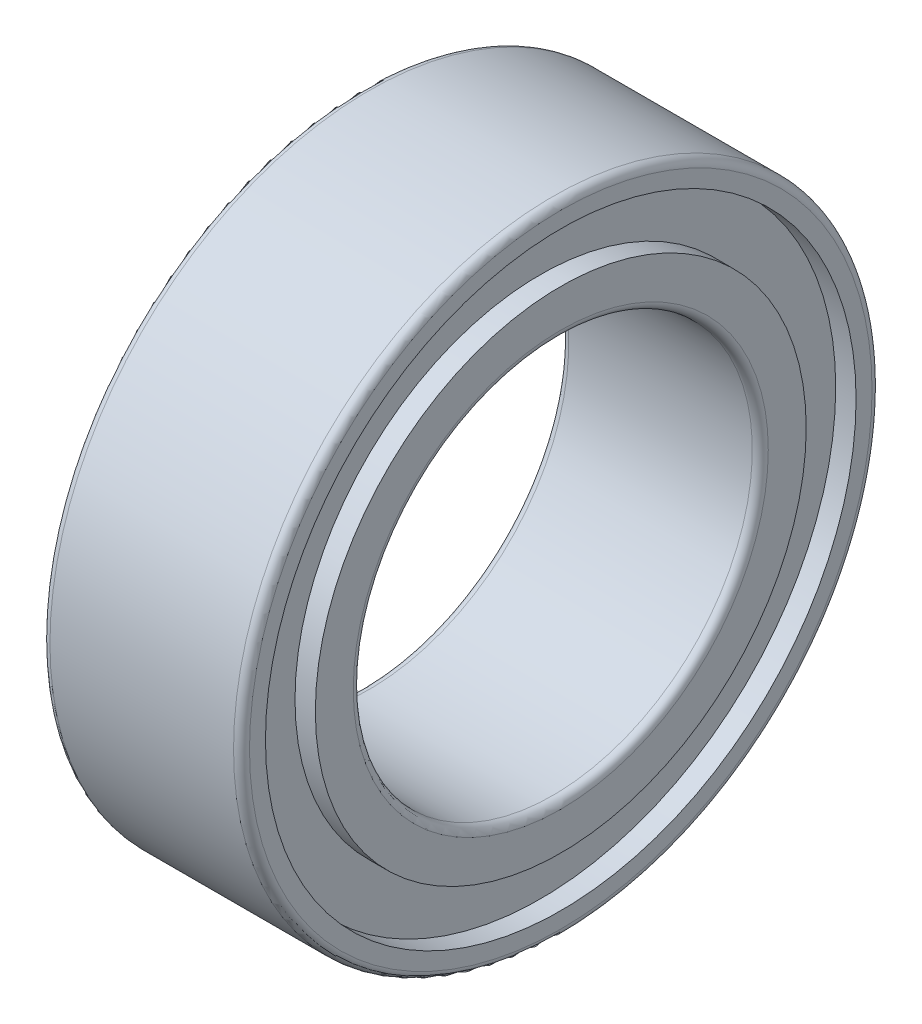
ISO-10303-21;
HEADER;
FILE_DESCRIPTION(('STEP AP214'),'2;1');
FILE_NAME('part.step','',(''),(''),'','','');
FILE_SCHEMA(('AUTOMOTIVE_DESIGN { 1 0 10303 214 1 1 1 1 }'));
ENDSEC;
DATA;
#1=APPLICATION_CONTEXT('core data for automotive mechanical design processes');
#2=APPLICATION_PROTOCOL_DEFINITION('international standard','automotive_design',2000,#1);
#3=PRODUCT_CONTEXT('',#1,'mechanical');
#4=PRODUCT('Part','Part','',(#3));
#5=PRODUCT_RELATED_PRODUCT_CATEGORY('part','',(#4));
#6=PRODUCT_DEFINITION_FORMATION('','',#4);
#7=PRODUCT_DEFINITION_CONTEXT('part definition',#1,'design');
#8=PRODUCT_DEFINITION('design','',#6,#7);
#9=PRODUCT_DEFINITION_SHAPE('','',#8);
#10=(LENGTH_UNIT() NAMED_UNIT(*) SI_UNIT(.MILLI.,.METRE.));
#11=(NAMED_UNIT(*) PLANE_ANGLE_UNIT() SI_UNIT($,.RADIAN.));
#12=(NAMED_UNIT(*) SI_UNIT($,.STERADIAN.) SOLID_ANGLE_UNIT());
#13=UNCERTAINTY_MEASURE_WITH_UNIT(LENGTH_MEASURE(1.E-05),#10,'distance_accuracy_value','');
#14=(GEOMETRIC_REPRESENTATION_CONTEXT(3) GLOBAL_UNCERTAINTY_ASSIGNED_CONTEXT((#13)) GLOBAL_UNIT_ASSIGNED_CONTEXT((#10,
#11,#12)) REPRESENTATION_CONTEXT('',''));
#15=CARTESIAN_POINT('',(0.,0.,0.));
#16=DIRECTION('',(0.,0.,1.));
#17=DIRECTION('',(1.,0.,0.));
#18=AXIS2_PLACEMENT_3D('',#15,#16,#17);
#19=CARTESIAN_POINT('',(0.0999999999999222,0.,0.));
#20=DIRECTION('',(-1.,0.,0.));
#21=DIRECTION('',(0.,0.,1.));
#22=AXIS2_PLACEMENT_3D('',#19,#20,#21);
#23=TOROIDAL_SURFACE('',#22,3.90000000000008,0.099999999999922);
#24=CARTESIAN_POINT('',(0.,0.,0.));
#25=DIRECTION('',(-1.,0.,0.));
#26=DIRECTION('',(0.,0.,1.));
#27=AXIS2_PLACEMENT_3D('',#24,#25,#26);
#28=CIRCLE('',#27,3.9);
#29=CARTESIAN_POINT('',(0.,0.,3.9));
#30=VERTEX_POINT('',#29);
#31=EDGE_CURVE('E10',#30,#30,#28,.T.);
#32=ORIENTED_EDGE('',*,*,#31,.F.);
#33=EDGE_LOOP('',(#32));
#34=FACE_BOUND('',#33,.T.);
#35=CARTESIAN_POINT('',(0.0999999999999998,0.,0.));
#36=DIRECTION('',(-1.,0.,0.));
#37=DIRECTION('',(0.,0.,1.));
#38=AXIS2_PLACEMENT_3D('',#35,#36,#37);
#39=CIRCLE('',#38,4.);
#40=CARTESIAN_POINT('',(0.0999999999999998,0.,4.));
#41=VERTEX_POINT('',#40);
#42=EDGE_CURVE('E81',#41,#41,#39,.T.);
#43=ORIENTED_EDGE('',*,*,#42,.T.);
#44=EDGE_LOOP('',(#43));
#45=FACE_BOUND('',#44,.T.);
#46=ADVANCED_FACE('F29',(#34,#45),#23,.T.);
#47=CARTESIAN_POINT('',(0.,3.9,0.));
#48=DIRECTION('',(1.,0.,0.));
#49=DIRECTION('',(0.,0.,-1.));
#50=AXIS2_PLACEMENT_3D('',#47,#48,#49);
#51=PLANE('',#50);
#52=CARTESIAN_POINT('',(0.,0.,0.));
#53=DIRECTION('',(-1.,0.,0.));
#54=DIRECTION('',(0.,0.,1.));
#55=AXIS2_PLACEMENT_3D('',#52,#53,#54);
#56=CIRCLE('',#55,3.7);
#57=CARTESIAN_POINT('',(0.,0.,3.7));
#58=VERTEX_POINT('',#57);
#59=EDGE_CURVE('E35',#58,#58,#56,.T.);
#60=ORIENTED_EDGE('',*,*,#59,.F.);
#61=EDGE_LOOP('',(#60));
#62=FACE_BOUND('',#61,.T.);
#63=ORIENTED_EDGE('',*,*,#31,.T.);
#64=EDGE_LOOP('',(#63));
#65=FACE_BOUND('',#64,.T.);
#66=ADVANCED_FACE('F166',(#62,#65),#51,.F.);
#67=CARTESIAN_POINT('',(2.4,0.,0.));
#68=DIRECTION('',(-1.,0.,0.));
#69=DIRECTION('',(0.,0.,1.));
#70=AXIS2_PLACEMENT_3D('',#67,#68,#69);
#71=CYLINDRICAL_SURFACE('',#70,3.7);
#72=CARTESIAN_POINT('',(0.255,0.,0.));
#73=DIRECTION('',(-1.,0.,0.));
#74=DIRECTION('',(0.,0.,1.));
#75=AXIS2_PLACEMENT_3D('',#72,#73,#74);
#76=CIRCLE('',#75,3.7);
#77=CARTESIAN_POINT('',(0.255,0.,3.7));
#78=VERTEX_POINT('',#77);
#79=EDGE_CURVE('E39',#78,#78,#76,.T.);
#80=ORIENTED_EDGE('',*,*,#79,.F.);
#81=EDGE_LOOP('',(#80));
#82=FACE_BOUND('',#81,.T.);
#83=ORIENTED_EDGE('',*,*,#59,.T.);
#84=EDGE_LOOP('',(#83));
#85=FACE_BOUND('',#84,.T.);
#86=ADVANCED_FACE('F161',(#82,#85),#71,.F.);
#87=CARTESIAN_POINT('',(0.255,3.7,0.));
#88=DIRECTION('',(1.,0.,0.));
#89=DIRECTION('',(0.,0.,-1.));
#90=AXIS2_PLACEMENT_3D('',#87,#88,#89);
#91=PLANE('',#90);
#92=CARTESIAN_POINT('',(0.255,0.,0.));
#93=DIRECTION('',(-1.,0.,0.));
#94=DIRECTION('',(0.,0.,1.));
#95=AXIS2_PLACEMENT_3D('',#92,#93,#94);
#96=CIRCLE('',#95,3.075);
#97=CARTESIAN_POINT('',(0.255,0.,3.075));
#98=VERTEX_POINT('',#97);
#99=EDGE_CURVE('E43',#98,#98,#96,.T.);
#100=ORIENTED_EDGE('',*,*,#99,.F.);
#101=EDGE_LOOP('',(#100));
#102=FACE_BOUND('',#101,.T.);
#103=ORIENTED_EDGE('',*,*,#79,.T.);
#104=EDGE_LOOP('',(#103));
#105=FACE_BOUND('',#104,.T.);
#106=ADVANCED_FACE('F155',(#102,#105),#91,.F.);
#107=CARTESIAN_POINT('',(2.4,0.,0.));
#108=DIRECTION('',(-1.,0.,0.));
#109=DIRECTION('',(0.,0.,1.));
#110=AXIS2_PLACEMENT_3D('',#107,#108,#109);
#111=CYLINDRICAL_SURFACE('',#110,3.075);
#112=CARTESIAN_POINT('',(0.,0.,0.));
#113=DIRECTION('',(-1.,0.,0.));
#114=DIRECTION('',(0.,0.,1.));
#115=AXIS2_PLACEMENT_3D('',#112,#113,#114);
#116=CIRCLE('',#115,3.075);
#117=CARTESIAN_POINT('',(0.,0.,3.075));
#118=VERTEX_POINT('',#117);
#119=EDGE_CURVE('E48',#118,#118,#116,.T.);
#120=ORIENTED_EDGE('',*,*,#119,.F.);
#121=EDGE_LOOP('',(#120));
#122=FACE_BOUND('',#121,.T.);
#123=ORIENTED_EDGE('',*,*,#99,.T.);
#124=EDGE_LOOP('',(#123));
#125=FACE_BOUND('',#124,.T.);
#126=ADVANCED_FACE('F149',(#122,#125),#111,.T.);
#127=CARTESIAN_POINT('',(0.,3.075,0.));
#128=DIRECTION('',(1.,0.,0.));
#129=DIRECTION('',(0.,0.,-1.));
#130=AXIS2_PLACEMENT_3D('',#127,#128,#129);
#131=PLANE('',#130);
#132=CARTESIAN_POINT('',(0.,0.,0.));
#133=DIRECTION('',(-1.,0.,0.));
#134=DIRECTION('',(0.,0.,1.));
#135=AXIS2_PLACEMENT_3D('',#132,#133,#134);
#136=CIRCLE('',#135,2.6);
#137=CARTESIAN_POINT('',(0.,0.,2.6));
#138=VERTEX_POINT('',#137);
#139=EDGE_CURVE('E51',#138,#138,#136,.T.);
#140=ORIENTED_EDGE('',*,*,#139,.F.);
#141=EDGE_LOOP('',(#140));
#142=FACE_BOUND('',#141,.T.);
#143=ORIENTED_EDGE('',*,*,#119,.T.);
#144=EDGE_LOOP('',(#143));
#145=FACE_BOUND('',#144,.T.);
#146=ADVANCED_FACE('F143',(#142,#145),#131,.F.);
#147=CARTESIAN_POINT('',(0.0999999999999218,0.,0.));
#148=DIRECTION('',(-1.,0.,0.));
#149=DIRECTION('',(0.,0.,1.));
#150=AXIS2_PLACEMENT_3D('',#147,#148,#149);
#151=TOROIDAL_SURFACE('',#150,2.59999999999992,0.099999999999922);
#152=CARTESIAN_POINT('',(0.0999999999999998,0.,0.));
#153=DIRECTION('',(-1.,0.,0.));
#154=DIRECTION('',(0.,0.,1.));
#155=AXIS2_PLACEMENT_3D('',#152,#153,#154);
#156=CIRCLE('',#155,2.5);
#157=CARTESIAN_POINT('',(0.0999999999999998,0.,2.5));
#158=VERTEX_POINT('',#157);
#159=EDGE_CURVE('E54',#158,#158,#156,.T.);
#160=ORIENTED_EDGE('',*,*,#159,.F.);
#161=EDGE_LOOP('',(#160));
#162=FACE_BOUND('',#161,.T.);
#163=ORIENTED_EDGE('',*,*,#139,.T.);
#164=EDGE_LOOP('',(#163));
#165=FACE_BOUND('',#164,.T.);
#166=ADVANCED_FACE('F137',(#162,#165),#151,.T.);
#167=CARTESIAN_POINT('',(2.4,0.,0.));
#168=DIRECTION('',(-1.,0.,0.));
#169=DIRECTION('',(0.,0.,1.));
#170=AXIS2_PLACEMENT_3D('',#167,#168,#169);
#171=CYLINDRICAL_SURFACE('',#170,2.5);
#172=CARTESIAN_POINT('',(2.4,0.,0.));
#173=DIRECTION('',(-1.,0.,0.));
#174=DIRECTION('',(0.,0.,1.));
#175=AXIS2_PLACEMENT_3D('',#172,#173,#174);
#176=CIRCLE('',#175,2.5);
#177=CARTESIAN_POINT('',(2.4,0.,2.5));
#178=VERTEX_POINT('',#177);
#179=EDGE_CURVE('E57',#178,#178,#176,.T.);
#180=ORIENTED_EDGE('',*,*,#179,.F.);
#181=EDGE_LOOP('',(#180));
#182=FACE_BOUND('',#181,.T.);
#183=ORIENTED_EDGE('',*,*,#159,.T.);
#184=EDGE_LOOP('',(#183));
#185=FACE_BOUND('',#184,.T.);
#186=ADVANCED_FACE('F131',(#182,#185),#171,.F.);
#187=CARTESIAN_POINT('',(2.40000000000015,0.,0.));
#188=DIRECTION('',(-1.,0.,0.));
#189=DIRECTION('',(0.,0.,1.));
#190=AXIS2_PLACEMENT_3D('',#187,#188,#189);
#191=TOROIDAL_SURFACE('',#190,2.59999999999985,0.099999999999845);
#192=CARTESIAN_POINT('',(2.5,0.,0.));
#193=DIRECTION('',(-1.,0.,0.));
#194=DIRECTION('',(0.,0.,1.));
#195=AXIS2_PLACEMENT_3D('',#192,#193,#194);
#196=CIRCLE('',#195,2.6);
#197=CARTESIAN_POINT('',(2.5,0.,2.6));
#198=VERTEX_POINT('',#197);
#199=EDGE_CURVE('E60',#198,#198,#196,.T.);
#200=ORIENTED_EDGE('',*,*,#199,.F.);
#201=EDGE_LOOP('',(#200));
#202=FACE_BOUND('',#201,.T.);
#203=ORIENTED_EDGE('',*,*,#179,.T.);
#204=EDGE_LOOP('',(#203));
#205=FACE_BOUND('',#204,.T.);
#206=ADVANCED_FACE('F125',(#202,#205),#191,.T.);
#207=CARTESIAN_POINT('',(2.5,2.6,0.));
#208=DIRECTION('',(-1.,0.,0.));
#209=DIRECTION('',(0.,0.,1.));
#210=AXIS2_PLACEMENT_3D('',#207,#208,#209);
#211=PLANE('',#210);
#212=CARTESIAN_POINT('',(2.5,0.,0.));
#213=DIRECTION('',(-1.,0.,0.));
#214=DIRECTION('',(0.,0.,1.));
#215=AXIS2_PLACEMENT_3D('',#212,#213,#214);
#216=CIRCLE('',#215,3.075);
#217=CARTESIAN_POINT('',(2.5,0.,3.075));
#218=VERTEX_POINT('',#217);
#219=EDGE_CURVE('E63',#218,#218,#216,.T.);
#220=ORIENTED_EDGE('',*,*,#219,.F.);
#221=EDGE_LOOP('',(#220));
#222=FACE_BOUND('',#221,.T.);
#223=ORIENTED_EDGE('',*,*,#199,.T.);
#224=EDGE_LOOP('',(#223));
#225=FACE_BOUND('',#224,.T.);
#226=ADVANCED_FACE('F119',(#222,#225),#211,.F.);
#227=CARTESIAN_POINT('',(2.4,0.,0.));
#228=DIRECTION('',(-1.,0.,0.));
#229=DIRECTION('',(0.,0.,1.));
#230=AXIS2_PLACEMENT_3D('',#227,#228,#229);
#231=CYLINDRICAL_SURFACE('',#230,3.075);
#232=CARTESIAN_POINT('',(2.245,0.,0.));
#233=DIRECTION('',(-1.,0.,0.));
#234=DIRECTION('',(0.,0.,1.));
#235=AXIS2_PLACEMENT_3D('',#232,#233,#234);
#236=CIRCLE('',#235,3.075);
#237=CARTESIAN_POINT('',(2.245,0.,3.075));
#238=VERTEX_POINT('',#237);
#239=EDGE_CURVE('E66',#238,#238,#236,.T.);
#240=ORIENTED_EDGE('',*,*,#239,.F.);
#241=EDGE_LOOP('',(#240));
#242=FACE_BOUND('',#241,.T.);
#243=ORIENTED_EDGE('',*,*,#219,.T.);
#244=EDGE_LOOP('',(#243));
#245=FACE_BOUND('',#244,.T.);
#246=ADVANCED_FACE('F113',(#242,#245),#231,.T.);
#247=CARTESIAN_POINT('',(2.245,3.075,0.));
#248=DIRECTION('',(-1.,0.,0.));
#249=DIRECTION('',(0.,0.,1.));
#250=AXIS2_PLACEMENT_3D('',#247,#248,#249);
#251=PLANE('',#250);
#252=CARTESIAN_POINT('',(2.245,0.,0.));
#253=DIRECTION('',(-1.,0.,0.));
#254=DIRECTION('',(0.,0.,1.));
#255=AXIS2_PLACEMENT_3D('',#252,#253,#254);
#256=CIRCLE('',#255,3.7);
#257=CARTESIAN_POINT('',(2.245,0.,3.7));
#258=VERTEX_POINT('',#257);
#259=EDGE_CURVE('E69',#258,#258,#256,.T.);
#260=ORIENTED_EDGE('',*,*,#259,.F.);
#261=EDGE_LOOP('',(#260));
#262=FACE_BOUND('',#261,.T.);
#263=ORIENTED_EDGE('',*,*,#239,.T.);
#264=EDGE_LOOP('',(#263));
#265=FACE_BOUND('',#264,.T.);
#266=ADVANCED_FACE('F107',(#262,#265),#251,.F.);
#267=CARTESIAN_POINT('',(2.4,0.,0.));
#268=DIRECTION('',(-1.,0.,0.));
#269=DIRECTION('',(0.,0.,1.));
#270=AXIS2_PLACEMENT_3D('',#267,#268,#269);
#271=CYLINDRICAL_SURFACE('',#270,3.7);
#272=CARTESIAN_POINT('',(2.5,0.,0.));
#273=DIRECTION('',(-1.,0.,0.));
#274=DIRECTION('',(0.,0.,1.));
#275=AXIS2_PLACEMENT_3D('',#272,#273,#274);
#276=CIRCLE('',#275,3.7);
#277=CARTESIAN_POINT('',(2.5,0.,3.7));
#278=VERTEX_POINT('',#277);
#279=EDGE_CURVE('E72',#278,#278,#276,.T.);
#280=ORIENTED_EDGE('',*,*,#279,.F.);
#281=EDGE_LOOP('',(#280));
#282=FACE_BOUND('',#281,.T.);
#283=ORIENTED_EDGE('',*,*,#259,.T.);
#284=EDGE_LOOP('',(#283));
#285=FACE_BOUND('',#284,.T.);
#286=ADVANCED_FACE('F101',(#282,#285),#271,.F.);
#287=CARTESIAN_POINT('',(2.5,3.7,0.));
#288=DIRECTION('',(-1.,0.,0.));
#289=DIRECTION('',(0.,0.,1.));
#290=AXIS2_PLACEMENT_3D('',#287,#288,#289);
#291=PLANE('',#290);
#292=CARTESIAN_POINT('',(2.5,0.,0.));
#293=DIRECTION('',(-1.,0.,0.));
#294=DIRECTION('',(0.,0.,1.));
#295=AXIS2_PLACEMENT_3D('',#292,#293,#294);
#296=CIRCLE('',#295,3.9);
#297=CARTESIAN_POINT('',(2.5,0.,3.9));
#298=VERTEX_POINT('',#297);
#299=EDGE_CURVE('E75',#298,#298,#296,.T.);
#300=ORIENTED_EDGE('',*,*,#299,.F.);
#301=EDGE_LOOP('',(#300));
#302=FACE_BOUND('',#301,.T.);
#303=ORIENTED_EDGE('',*,*,#279,.T.);
#304=EDGE_LOOP('',(#303));
#305=FACE_BOUND('',#304,.T.);
#306=ADVANCED_FACE('F95',(#302,#305),#291,.F.);
#307=CARTESIAN_POINT('',(2.40000000000015,0.,0.));
#308=DIRECTION('',(-1.,0.,0.));
#309=DIRECTION('',(0.,0.,1.));
#310=AXIS2_PLACEMENT_3D('',#307,#308,#309);
#311=TOROIDAL_SURFACE('',#310,3.90000000000015,0.0999999999998461);
#312=CARTESIAN_POINT('',(2.4,0.,0.));
#313=DIRECTION('',(-1.,0.,0.));
#314=DIRECTION('',(0.,0.,1.));
#315=AXIS2_PLACEMENT_3D('',#312,#313,#314);
#316=CIRCLE('',#315,4.);
#317=CARTESIAN_POINT('',(2.4,0.,4.));
#318=VERTEX_POINT('',#317);
#319=EDGE_CURVE('E78',#318,#318,#316,.T.);
#320=ORIENTED_EDGE('',*,*,#319,.F.);
#321=EDGE_LOOP('',(#320));
#322=FACE_BOUND('',#321,.T.);
#323=ORIENTED_EDGE('',*,*,#299,.T.);
#324=EDGE_LOOP('',(#323));
#325=FACE_BOUND('',#324,.T.);
#326=ADVANCED_FACE('F89',(#322,#325),#311,.T.);
#327=CARTESIAN_POINT('',(2.4,0.,0.));
#328=DIRECTION('',(-1.,0.,0.));
#329=DIRECTION('',(0.,0.,1.));
#330=AXIS2_PLACEMENT_3D('',#327,#328,#329);
#331=CYLINDRICAL_SURFACE('',#330,4.);
#332=ORIENTED_EDGE('',*,*,#42,.F.);
#333=EDGE_LOOP('',(#332));
#334=FACE_BOUND('',#333,.T.);
#335=ORIENTED_EDGE('',*,*,#319,.T.);
#336=EDGE_LOOP('',(#335));
#337=FACE_BOUND('',#336,.T.);
#338=ADVANCED_FACE('F86',(#334,#337),#331,.T.);
#339=CLOSED_SHELL('',(#46,#66,#86,#106,#126,#146,#166,#186,#206,#226,#246,#266,#286,#306,#326,#338));
#340=MANIFOLD_SOLID_BREP('B2',#339);
#341=ADVANCED_BREP_SHAPE_REPRESENTATION('',(#18,#340),#14);
#342=SHAPE_DEFINITION_REPRESENTATION(#9,#341);
ENDSEC;
END-ISO-10303-21;
